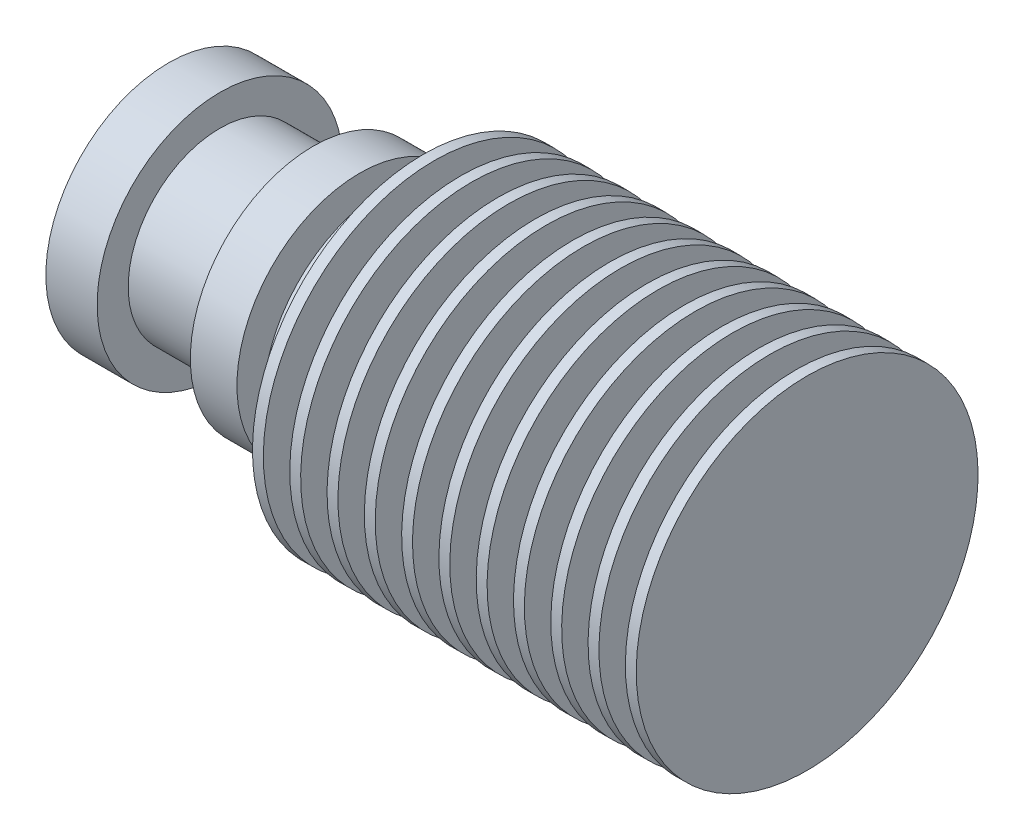
ISO-10303-21;
HEADER;
FILE_DESCRIPTION(('STEP AP214'),'2;1');
FILE_NAME('part.step','',(''),(''),'','','');
FILE_SCHEMA(('AUTOMOTIVE_DESIGN { 1 0 10303 214 1 1 1 1 }'));
ENDSEC;
DATA;
#1=APPLICATION_CONTEXT('core data for automotive mechanical design processes');
#2=APPLICATION_PROTOCOL_DEFINITION('international standard','automotive_design',2000,#1);
#3=PRODUCT_CONTEXT('',#1,'mechanical');
#4=PRODUCT('Part','Part','',(#3));
#5=PRODUCT_RELATED_PRODUCT_CATEGORY('part','',(#4));
#6=PRODUCT_DEFINITION_FORMATION('','',#4);
#7=PRODUCT_DEFINITION_CONTEXT('part definition',#1,'design');
#8=PRODUCT_DEFINITION('design','',#6,#7);
#9=PRODUCT_DEFINITION_SHAPE('','',#8);
#10=(LENGTH_UNIT() NAMED_UNIT(*) SI_UNIT(.MILLI.,.METRE.));
#11=(NAMED_UNIT(*) PLANE_ANGLE_UNIT() SI_UNIT($,.RADIAN.));
#12=(NAMED_UNIT(*) SI_UNIT($,.STERADIAN.) SOLID_ANGLE_UNIT());
#13=UNCERTAINTY_MEASURE_WITH_UNIT(LENGTH_MEASURE(1.E-05),#10,'distance_accuracy_value','');
#14=(GEOMETRIC_REPRESENTATION_CONTEXT(3) GLOBAL_UNCERTAINTY_ASSIGNED_CONTEXT((#13)) GLOBAL_UNIT_ASSIGNED_CONTEXT((#10,
#11,#12)) REPRESENTATION_CONTEXT('',''));
#15=CARTESIAN_POINT('',(0.,0.,0.));
#16=DIRECTION('',(0.,0.,1.));
#17=DIRECTION('',(1.,0.,0.));
#18=AXIS2_PLACEMENT_3D('',#15,#16,#17);
#19=CARTESIAN_POINT('',(-27.999975,5.,0.));
#20=DIRECTION('',(1.,0.,0.));
#21=DIRECTION('',(0.,1.,0.));
#22=AXIS2_PLACEMENT_3D('',#19,#20,#21);
#23=PLANE('',#22);
#24=CARTESIAN_POINT('',(-27.999975,5.,0.));
#25=DIRECTION('',(1.,0.,0.));
#26=DIRECTION('',(0.,1.,0.));
#27=AXIS2_PLACEMENT_3D('',#24,#25,#26);
#28=CIRCLE('',#27,11.);
#29=CARTESIAN_POINT('',(-27.999975,16.,0.));
#30=VERTEX_POINT('',#29);
#31=EDGE_CURVE('E10',#30,#30,#28,.T.);
#32=ORIENTED_EDGE('',*,*,#31,.T.);
#33=EDGE_LOOP('',(#32));
#34=FACE_BOUND('',#33,.T.);
#35=ADVANCED_FACE('F32',(#34),#23,.T.);
#36=CARTESIAN_POINT('',(-27.999975,5.,0.));
#37=DIRECTION('',(1.,0.,0.));
#38=DIRECTION('',(0.,1.,0.));
#39=AXIS2_PLACEMENT_3D('',#36,#37,#38);
#40=CYLINDRICAL_SURFACE('',#39,11.);
#41=CARTESIAN_POINT('',(-28.699975,5.,0.));
#42=DIRECTION('',(1.,0.,0.));
#43=DIRECTION('',(0.,1.,0.));
#44=AXIS2_PLACEMENT_3D('',#41,#42,#43);
#45=CIRCLE('',#44,11.);
#46=CARTESIAN_POINT('',(-28.699975,16.,0.));
#47=VERTEX_POINT('',#46);
#48=EDGE_CURVE('E38',#47,#47,#45,.T.);
#49=ORIENTED_EDGE('',*,*,#48,.T.);
#50=EDGE_LOOP('',(#49));
#51=FACE_BOUND('',#50,.T.);
#52=ORIENTED_EDGE('',*,*,#31,.F.);
#53=EDGE_LOOP('',(#52));
#54=FACE_BOUND('',#53,.T.);
#55=ADVANCED_FACE('F531',(#51,#54),#40,.T.);
#56=CARTESIAN_POINT('',(-28.699975,16.,0.));
#57=DIRECTION('',(-1.,0.,0.));
#58=DIRECTION('',(0.,-1.,0.));
#59=AXIS2_PLACEMENT_3D('',#56,#57,#58);
#60=PLANE('',#59);
#61=CARTESIAN_POINT('',(-28.699975,5.,0.));
#62=DIRECTION('',(1.,0.,0.));
#63=DIRECTION('',(0.,1.,0.));
#64=AXIS2_PLACEMENT_3D('',#61,#62,#63);
#65=CIRCLE('',#64,5.);
#66=CARTESIAN_POINT('',(-28.699975,10.,0.));
#67=VERTEX_POINT('',#66);
#68=EDGE_CURVE('E42',#67,#67,#65,.T.);
#69=ORIENTED_EDGE('',*,*,#68,.T.);
#70=EDGE_LOOP('',(#69));
#71=FACE_BOUND('',#70,.T.);
#72=ORIENTED_EDGE('',*,*,#48,.F.);
#73=EDGE_LOOP('',(#72));
#74=FACE_BOUND('',#73,.T.);
#75=ADVANCED_FACE('F525',(#71,#74),#60,.T.);
#76=CARTESIAN_POINT('',(-27.999975,5.,0.));
#77=DIRECTION('',(1.,0.,0.));
#78=DIRECTION('',(0.,1.,0.));
#79=AXIS2_PLACEMENT_3D('',#76,#77,#78);
#80=CYLINDRICAL_SURFACE('',#79,5.);
#81=CARTESIAN_POINT('',(-30.399975,5.,0.));
#82=DIRECTION('',(1.,0.,0.));
#83=DIRECTION('',(0.,1.,0.));
#84=AXIS2_PLACEMENT_3D('',#81,#82,#83);
#85=CIRCLE('',#84,5.);
#86=CARTESIAN_POINT('',(-30.399975,10.,0.));
#87=VERTEX_POINT('',#86);
#88=EDGE_CURVE('E46',#87,#87,#85,.T.);
#89=ORIENTED_EDGE('',*,*,#88,.T.);
#90=EDGE_LOOP('',(#89));
#91=FACE_BOUND('',#90,.T.);
#92=ORIENTED_EDGE('',*,*,#68,.F.);
#93=EDGE_LOOP('',(#92));
#94=FACE_BOUND('',#93,.T.);
#95=ADVANCED_FACE('F519',(#91,#94),#80,.T.);
#96=CARTESIAN_POINT('',(-30.399975,10.,0.));
#97=DIRECTION('',(1.,0.,0.));
#98=DIRECTION('',(0.,1.,0.));
#99=AXIS2_PLACEMENT_3D('',#96,#97,#98);
#100=PLANE('',#99);
#101=CARTESIAN_POINT('',(-30.399975,5.,0.));
#102=DIRECTION('',(1.,0.,0.));
#103=DIRECTION('',(0.,1.,0.));
#104=AXIS2_PLACEMENT_3D('',#101,#102,#103);
#105=CIRCLE('',#104,11.);
#106=CARTESIAN_POINT('',(-30.399975,16.,0.));
#107=VERTEX_POINT('',#106);
#108=EDGE_CURVE('E51',#107,#107,#105,.T.);
#109=ORIENTED_EDGE('',*,*,#108,.T.);
#110=EDGE_LOOP('',(#109));
#111=FACE_BOUND('',#110,.T.);
#112=ORIENTED_EDGE('',*,*,#88,.F.);
#113=EDGE_LOOP('',(#112));
#114=FACE_BOUND('',#113,.T.);
#115=ADVANCED_FACE('F513',(#111,#114),#100,.T.);
#116=CARTESIAN_POINT('',(-27.999975,5.,0.));
#117=DIRECTION('',(1.,0.,0.));
#118=DIRECTION('',(0.,1.,0.));
#119=AXIS2_PLACEMENT_3D('',#116,#117,#118);
#120=CYLINDRICAL_SURFACE('',#119,11.);
#121=CARTESIAN_POINT('',(-31.099975,5.,0.));
#122=DIRECTION('',(1.,0.,0.));
#123=DIRECTION('',(0.,1.,0.));
#124=AXIS2_PLACEMENT_3D('',#121,#122,#123);
#125=CIRCLE('',#124,11.);
#126=CARTESIAN_POINT('',(-31.099975,16.,0.));
#127=VERTEX_POINT('',#126);
#128=EDGE_CURVE('E54',#127,#127,#125,.T.);
#129=ORIENTED_EDGE('',*,*,#128,.T.);
#130=EDGE_LOOP('',(#129));
#131=FACE_BOUND('',#130,.T.);
#132=ORIENTED_EDGE('',*,*,#108,.F.);
#133=EDGE_LOOP('',(#132));
#134=FACE_BOUND('',#133,.T.);
#135=ADVANCED_FACE('F507',(#131,#134),#120,.T.);
#136=CARTESIAN_POINT('',(-31.099975,16.,0.));
#137=DIRECTION('',(-1.,0.,0.));
#138=DIRECTION('',(0.,-1.,0.));
#139=AXIS2_PLACEMENT_3D('',#136,#137,#138);
#140=PLANE('',#139);
#141=CARTESIAN_POINT('',(-31.099975,5.,0.));
#142=DIRECTION('',(1.,0.,0.));
#143=DIRECTION('',(0.,1.,0.));
#144=AXIS2_PLACEMENT_3D('',#141,#142,#143);
#145=CIRCLE('',#144,4.99999999999998);
#146=CARTESIAN_POINT('',(-31.099975,9.99999999999998,0.));
#147=VERTEX_POINT('',#146);
#148=EDGE_CURVE('E57',#147,#147,#145,.T.);
#149=ORIENTED_EDGE('',*,*,#148,.T.);
#150=EDGE_LOOP('',(#149));
#151=FACE_BOUND('',#150,.T.);
#152=ORIENTED_EDGE('',*,*,#128,.F.);
#153=EDGE_LOOP('',(#152));
#154=FACE_BOUND('',#153,.T.);
#155=ADVANCED_FACE('F501',(#151,#154),#140,.T.);
#156=CARTESIAN_POINT('',(-27.999975,5.,0.));
#157=DIRECTION('',(1.,0.,0.));
#158=DIRECTION('',(0.,1.,0.));
#159=AXIS2_PLACEMENT_3D('',#156,#157,#158);
#160=CYLINDRICAL_SURFACE('',#159,4.99999999999998);
#161=CARTESIAN_POINT('',(-32.799975,5.,0.));
#162=DIRECTION('',(1.,0.,0.));
#163=DIRECTION('',(0.,1.,0.));
#164=AXIS2_PLACEMENT_3D('',#161,#162,#163);
#165=CIRCLE('',#164,4.99999999999999);
#166=CARTESIAN_POINT('',(-32.799975,9.99999999999998,0.));
#167=VERTEX_POINT('',#166);
#168=EDGE_CURVE('E60',#167,#167,#165,.T.);
#169=ORIENTED_EDGE('',*,*,#168,.T.);
#170=EDGE_LOOP('',(#169));
#171=FACE_BOUND('',#170,.T.);
#172=ORIENTED_EDGE('',*,*,#148,.F.);
#173=EDGE_LOOP('',(#172));
#174=FACE_BOUND('',#173,.T.);
#175=ADVANCED_FACE('F495',(#171,#174),#160,.T.);
#176=CARTESIAN_POINT('',(-32.799975,9.99999999999998,0.));
#177=DIRECTION('',(1.,0.,0.));
#178=DIRECTION('',(0.,1.,0.));
#179=AXIS2_PLACEMENT_3D('',#176,#177,#178);
#180=PLANE('',#179);
#181=CARTESIAN_POINT('',(-32.799975,5.,0.));
#182=DIRECTION('',(1.,0.,0.));
#183=DIRECTION('',(0.,1.,0.));
#184=AXIS2_PLACEMENT_3D('',#181,#182,#183);
#185=CIRCLE('',#184,11.);
#186=CARTESIAN_POINT('',(-32.799975,16.,0.));
#187=VERTEX_POINT('',#186);
#188=EDGE_CURVE('E63',#187,#187,#185,.T.);
#189=ORIENTED_EDGE('',*,*,#188,.T.);
#190=EDGE_LOOP('',(#189));
#191=FACE_BOUND('',#190,.T.);
#192=ORIENTED_EDGE('',*,*,#168,.F.);
#193=EDGE_LOOP('',(#192));
#194=FACE_BOUND('',#193,.T.);
#195=ADVANCED_FACE('F489',(#191,#194),#180,.T.);
#196=CARTESIAN_POINT('',(-27.999975,5.,0.));
#197=DIRECTION('',(1.,0.,0.));
#198=DIRECTION('',(0.,1.,0.));
#199=AXIS2_PLACEMENT_3D('',#196,#197,#198);
#200=CYLINDRICAL_SURFACE('',#199,11.);
#201=CARTESIAN_POINT('',(-33.499975,5.,0.));
#202=DIRECTION('',(1.,0.,0.));
#203=DIRECTION('',(0.,1.,0.));
#204=AXIS2_PLACEMENT_3D('',#201,#202,#203);
#205=CIRCLE('',#204,11.);
#206=CARTESIAN_POINT('',(-33.499975,16.,0.));
#207=VERTEX_POINT('',#206);
#208=EDGE_CURVE('E66',#207,#207,#205,.T.);
#209=ORIENTED_EDGE('',*,*,#208,.T.);
#210=EDGE_LOOP('',(#209));
#211=FACE_BOUND('',#210,.T.);
#212=ORIENTED_EDGE('',*,*,#188,.F.);
#213=EDGE_LOOP('',(#212));
#214=FACE_BOUND('',#213,.T.);
#215=ADVANCED_FACE('F483',(#211,#214),#200,.T.);
#216=CARTESIAN_POINT('',(-33.499975,16.,0.));
#217=DIRECTION('',(-1.,0.,0.));
#218=DIRECTION('',(0.,-1.,0.));
#219=AXIS2_PLACEMENT_3D('',#216,#217,#218);
#220=PLANE('',#219);
#221=CARTESIAN_POINT('',(-33.499975,5.,0.));
#222=DIRECTION('',(1.,0.,0.));
#223=DIRECTION('',(0.,1.,0.));
#224=AXIS2_PLACEMENT_3D('',#221,#222,#223);
#225=CIRCLE('',#224,4.99999999999997);
#226=CARTESIAN_POINT('',(-33.499975,9.99999999999997,0.));
#227=VERTEX_POINT('',#226);
#228=EDGE_CURVE('E69',#227,#227,#225,.T.);
#229=ORIENTED_EDGE('',*,*,#228,.T.);
#230=EDGE_LOOP('',(#229));
#231=FACE_BOUND('',#230,.T.);
#232=ORIENTED_EDGE('',*,*,#208,.F.);
#233=EDGE_LOOP('',(#232));
#234=FACE_BOUND('',#233,.T.);
#235=ADVANCED_FACE('F477',(#231,#234),#220,.T.);
#236=CARTESIAN_POINT('',(-27.999975,5.,0.));
#237=DIRECTION('',(1.,0.,0.));
#238=DIRECTION('',(0.,1.,0.));
#239=AXIS2_PLACEMENT_3D('',#236,#237,#238);
#240=CYLINDRICAL_SURFACE('',#239,4.99999999999997);
#241=CARTESIAN_POINT('',(-35.199975,5.,0.));
#242=DIRECTION('',(1.,0.,0.));
#243=DIRECTION('',(0.,1.,0.));
#244=AXIS2_PLACEMENT_3D('',#241,#242,#243);
#245=CIRCLE('',#244,4.99999999999997);
#246=CARTESIAN_POINT('',(-35.199975,9.99999999999997,0.));
#247=VERTEX_POINT('',#246);
#248=EDGE_CURVE('E72',#247,#247,#245,.T.);
#249=ORIENTED_EDGE('',*,*,#248,.T.);
#250=EDGE_LOOP('',(#249));
#251=FACE_BOUND('',#250,.T.);
#252=ORIENTED_EDGE('',*,*,#228,.F.);
#253=EDGE_LOOP('',(#252));
#254=FACE_BOUND('',#253,.T.);
#255=ADVANCED_FACE('F471',(#251,#254),#240,.T.);
#256=CARTESIAN_POINT('',(-35.199975,9.99999999999997,0.));
#257=DIRECTION('',(1.,0.,0.));
#258=DIRECTION('',(0.,1.,0.));
#259=AXIS2_PLACEMENT_3D('',#256,#257,#258);
#260=PLANE('',#259);
#261=CARTESIAN_POINT('',(-35.199975,5.,0.));
#262=DIRECTION('',(1.,0.,0.));
#263=DIRECTION('',(0.,1.,0.));
#264=AXIS2_PLACEMENT_3D('',#261,#262,#263);
#265=CIRCLE('',#264,11.);
#266=CARTESIAN_POINT('',(-35.199975,16.,0.));
#267=VERTEX_POINT('',#266);
#268=EDGE_CURVE('E75',#267,#267,#265,.T.);
#269=ORIENTED_EDGE('',*,*,#268,.T.);
#270=EDGE_LOOP('',(#269));
#271=FACE_BOUND('',#270,.T.);
#272=ORIENTED_EDGE('',*,*,#248,.F.);
#273=EDGE_LOOP('',(#272));
#274=FACE_BOUND('',#273,.T.);
#275=ADVANCED_FACE('F465',(#271,#274),#260,.T.);
#276=CARTESIAN_POINT('',(-27.999975,5.,0.));
#277=DIRECTION('',(1.,0.,0.));
#278=DIRECTION('',(0.,1.,0.));
#279=AXIS2_PLACEMENT_3D('',#276,#277,#278);
#280=CYLINDRICAL_SURFACE('',#279,11.);
#281=CARTESIAN_POINT('',(-35.899975,5.,0.));
#282=DIRECTION('',(1.,0.,0.));
#283=DIRECTION('',(0.,1.,0.));
#284=AXIS2_PLACEMENT_3D('',#281,#282,#283);
#285=CIRCLE('',#284,11.);
#286=CARTESIAN_POINT('',(-35.899975,16.,0.));
#287=VERTEX_POINT('',#286);
#288=EDGE_CURVE('E78',#287,#287,#285,.T.);
#289=ORIENTED_EDGE('',*,*,#288,.T.);
#290=EDGE_LOOP('',(#289));
#291=FACE_BOUND('',#290,.T.);
#292=ORIENTED_EDGE('',*,*,#268,.F.);
#293=EDGE_LOOP('',(#292));
#294=FACE_BOUND('',#293,.T.);
#295=ADVANCED_FACE('F459',(#291,#294),#280,.T.);
#296=CARTESIAN_POINT('',(-35.899975,16.,0.));
#297=DIRECTION('',(-1.,0.,0.));
#298=DIRECTION('',(0.,-1.,0.));
#299=AXIS2_PLACEMENT_3D('',#296,#297,#298);
#300=PLANE('',#299);
#301=CARTESIAN_POINT('',(-35.899975,5.,0.));
#302=DIRECTION('',(1.,0.,0.));
#303=DIRECTION('',(0.,1.,0.));
#304=AXIS2_PLACEMENT_3D('',#301,#302,#303);
#305=CIRCLE('',#304,4.99999999999995);
#306=CARTESIAN_POINT('',(-35.899975,9.99999999999995,0.));
#307=VERTEX_POINT('',#306);
#308=EDGE_CURVE('E81',#307,#307,#305,.T.);
#309=ORIENTED_EDGE('',*,*,#308,.T.);
#310=EDGE_LOOP('',(#309));
#311=FACE_BOUND('',#310,.T.);
#312=ORIENTED_EDGE('',*,*,#288,.F.);
#313=EDGE_LOOP('',(#312));
#314=FACE_BOUND('',#313,.T.);
#315=ADVANCED_FACE('F453',(#311,#314),#300,.T.);
#316=CARTESIAN_POINT('',(-27.999975,5.,0.));
#317=DIRECTION('',(1.,0.,0.));
#318=DIRECTION('',(0.,1.,0.));
#319=AXIS2_PLACEMENT_3D('',#316,#317,#318);
#320=CYLINDRICAL_SURFACE('',#319,4.99999999999995);
#321=CARTESIAN_POINT('',(-37.599975,5.,0.));
#322=DIRECTION('',(1.,0.,0.));
#323=DIRECTION('',(0.,1.,0.));
#324=AXIS2_PLACEMENT_3D('',#321,#322,#323);
#325=CIRCLE('',#324,4.99999999999995);
#326=CARTESIAN_POINT('',(-37.599975,9.99999999999995,0.));
#327=VERTEX_POINT('',#326);
#328=EDGE_CURVE('E84',#327,#327,#325,.T.);
#329=ORIENTED_EDGE('',*,*,#328,.T.);
#330=EDGE_LOOP('',(#329));
#331=FACE_BOUND('',#330,.T.);
#332=ORIENTED_EDGE('',*,*,#308,.F.);
#333=EDGE_LOOP('',(#332));
#334=FACE_BOUND('',#333,.T.);
#335=ADVANCED_FACE('F447',(#331,#334),#320,.T.);
#336=CARTESIAN_POINT('',(-37.599975,9.99999999999995,0.));
#337=DIRECTION('',(1.,0.,0.));
#338=DIRECTION('',(0.,1.,0.));
#339=AXIS2_PLACEMENT_3D('',#336,#337,#338);
#340=PLANE('',#339);
#341=CARTESIAN_POINT('',(-37.599975,5.,0.));
#342=DIRECTION('',(1.,0.,0.));
#343=DIRECTION('',(0.,1.,0.));
#344=AXIS2_PLACEMENT_3D('',#341,#342,#343);
#345=CIRCLE('',#344,10.9999999999999);
#346=CARTESIAN_POINT('',(-37.599975,15.9999999999999,0.));
#347=VERTEX_POINT('',#346);
#348=EDGE_CURVE('E87',#347,#347,#345,.T.);
#349=ORIENTED_EDGE('',*,*,#348,.T.);
#350=EDGE_LOOP('',(#349));
#351=FACE_BOUND('',#350,.T.);
#352=ORIENTED_EDGE('',*,*,#328,.F.);
#353=EDGE_LOOP('',(#352));
#354=FACE_BOUND('',#353,.T.);
#355=ADVANCED_FACE('F441',(#351,#354),#340,.T.);
#356=CARTESIAN_POINT('',(-27.999975,5.,0.));
#357=DIRECTION('',(1.,0.,0.));
#358=DIRECTION('',(0.,1.,0.));
#359=AXIS2_PLACEMENT_3D('',#356,#357,#358);
#360=CYLINDRICAL_SURFACE('',#359,10.9999999999999);
#361=CARTESIAN_POINT('',(-38.299975,5.,0.));
#362=DIRECTION('',(1.,0.,0.));
#363=DIRECTION('',(0.,1.,0.));
#364=AXIS2_PLACEMENT_3D('',#361,#362,#363);
#365=CIRCLE('',#364,10.9999999999999);
#366=CARTESIAN_POINT('',(-38.299975,15.9999999999999,0.));
#367=VERTEX_POINT('',#366);
#368=EDGE_CURVE('E90',#367,#367,#365,.T.);
#369=ORIENTED_EDGE('',*,*,#368,.T.);
#370=EDGE_LOOP('',(#369));
#371=FACE_BOUND('',#370,.T.);
#372=ORIENTED_EDGE('',*,*,#348,.F.);
#373=EDGE_LOOP('',(#372));
#374=FACE_BOUND('',#373,.T.);
#375=ADVANCED_FACE('F435',(#371,#374),#360,.T.);
#376=CARTESIAN_POINT('',(-38.299975,15.9999999999999,0.));
#377=DIRECTION('',(-1.,0.,0.));
#378=DIRECTION('',(0.,-1.,0.));
#379=AXIS2_PLACEMENT_3D('',#376,#377,#378);
#380=PLANE('',#379);
#381=CARTESIAN_POINT('',(-38.299975,5.,0.));
#382=DIRECTION('',(1.,0.,0.));
#383=DIRECTION('',(0.,1.,0.));
#384=AXIS2_PLACEMENT_3D('',#381,#382,#383);
#385=CIRCLE('',#384,4.99999999999993);
#386=CARTESIAN_POINT('',(-38.299975,9.99999999999993,0.));
#387=VERTEX_POINT('',#386);
#388=EDGE_CURVE('E93',#387,#387,#385,.T.);
#389=ORIENTED_EDGE('',*,*,#388,.T.);
#390=EDGE_LOOP('',(#389));
#391=FACE_BOUND('',#390,.T.);
#392=ORIENTED_EDGE('',*,*,#368,.F.);
#393=EDGE_LOOP('',(#392));
#394=FACE_BOUND('',#393,.T.);
#395=ADVANCED_FACE('F429',(#391,#394),#380,.T.);
#396=CARTESIAN_POINT('',(-27.999975,5.,0.));
#397=DIRECTION('',(1.,0.,0.));
#398=DIRECTION('',(0.,1.,0.));
#399=AXIS2_PLACEMENT_3D('',#396,#397,#398);
#400=CYLINDRICAL_SURFACE('',#399,4.99999999999994);
#401=CARTESIAN_POINT('',(-39.999975,5.,0.));
#402=DIRECTION('',(1.,0.,0.));
#403=DIRECTION('',(0.,1.,0.));
#404=AXIS2_PLACEMENT_3D('',#401,#402,#403);
#405=CIRCLE('',#404,4.99999999999994);
#406=CARTESIAN_POINT('',(-39.999975,9.99999999999993,0.));
#407=VERTEX_POINT('',#406);
#408=EDGE_CURVE('E96',#407,#407,#405,.T.);
#409=ORIENTED_EDGE('',*,*,#408,.T.);
#410=EDGE_LOOP('',(#409));
#411=FACE_BOUND('',#410,.T.);
#412=ORIENTED_EDGE('',*,*,#388,.F.);
#413=EDGE_LOOP('',(#412));
#414=FACE_BOUND('',#413,.T.);
#415=ADVANCED_FACE('F423',(#411,#414),#400,.T.);
#416=CARTESIAN_POINT('',(-39.999975,9.99999999999993,0.));
#417=DIRECTION('',(1.,0.,0.));
#418=DIRECTION('',(0.,1.,0.));
#419=AXIS2_PLACEMENT_3D('',#416,#417,#418);
#420=PLANE('',#419);
#421=CARTESIAN_POINT('',(-39.999975,5.,0.));
#422=DIRECTION('',(1.,0.,0.));
#423=DIRECTION('',(0.,1.,0.));
#424=AXIS2_PLACEMENT_3D('',#421,#422,#423);
#425=CIRCLE('',#424,10.9999999999999);
#426=CARTESIAN_POINT('',(-39.999975,15.9999999999999,0.));
#427=VERTEX_POINT('',#426);
#428=EDGE_CURVE('E99',#427,#427,#425,.T.);
#429=ORIENTED_EDGE('',*,*,#428,.T.);
#430=EDGE_LOOP('',(#429));
#431=FACE_BOUND('',#430,.T.);
#432=ORIENTED_EDGE('',*,*,#408,.F.);
#433=EDGE_LOOP('',(#432));
#434=FACE_BOUND('',#433,.T.);
#435=ADVANCED_FACE('F417',(#431,#434),#420,.T.);
#436=CARTESIAN_POINT('',(-27.999975,5.,0.));
#437=DIRECTION('',(1.,0.,0.));
#438=DIRECTION('',(0.,1.,0.));
#439=AXIS2_PLACEMENT_3D('',#436,#437,#438);
#440=CYLINDRICAL_SURFACE('',#439,10.9999999999999);
#441=CARTESIAN_POINT('',(-40.699975,5.,0.));
#442=DIRECTION('',(1.,0.,0.));
#443=DIRECTION('',(0.,1.,0.));
#444=AXIS2_PLACEMENT_3D('',#441,#442,#443);
#445=CIRCLE('',#444,10.9999999999999);
#446=CARTESIAN_POINT('',(-40.699975,15.9999999999999,0.));
#447=VERTEX_POINT('',#446);
#448=EDGE_CURVE('E102',#447,#447,#445,.T.);
#449=ORIENTED_EDGE('',*,*,#448,.T.);
#450=EDGE_LOOP('',(#449));
#451=FACE_BOUND('',#450,.T.);
#452=ORIENTED_EDGE('',*,*,#428,.F.);
#453=EDGE_LOOP('',(#452));
#454=FACE_BOUND('',#453,.T.);
#455=ADVANCED_FACE('F411',(#451,#454),#440,.T.);
#456=CARTESIAN_POINT('',(-40.699975,15.9999999999999,0.));
#457=DIRECTION('',(-1.,0.,0.));
#458=DIRECTION('',(0.,-1.,0.));
#459=AXIS2_PLACEMENT_3D('',#456,#457,#458);
#460=PLANE('',#459);
#461=CARTESIAN_POINT('',(-40.699975,5.,0.));
#462=DIRECTION('',(1.,0.,0.));
#463=DIRECTION('',(0.,1.,0.));
#464=AXIS2_PLACEMENT_3D('',#461,#462,#463);
#465=CIRCLE('',#464,4.99999999999992);
#466=CARTESIAN_POINT('',(-40.699975,9.99999999999992,0.));
#467=VERTEX_POINT('',#466);
#468=EDGE_CURVE('E105',#467,#467,#465,.T.);
#469=ORIENTED_EDGE('',*,*,#468,.T.);
#470=EDGE_LOOP('',(#469));
#471=FACE_BOUND('',#470,.T.);
#472=ORIENTED_EDGE('',*,*,#448,.F.);
#473=EDGE_LOOP('',(#472));
#474=FACE_BOUND('',#473,.T.);
#475=ADVANCED_FACE('F405',(#471,#474),#460,.T.);
#476=CARTESIAN_POINT('',(-27.999975,5.,0.));
#477=DIRECTION('',(1.,0.,0.));
#478=DIRECTION('',(0.,1.,0.));
#479=AXIS2_PLACEMENT_3D('',#476,#477,#478);
#480=CYLINDRICAL_SURFACE('',#479,4.99999999999992);
#481=CARTESIAN_POINT('',(-42.399975,5.,0.));
#482=DIRECTION('',(1.,0.,0.));
#483=DIRECTION('',(0.,1.,0.));
#484=AXIS2_PLACEMENT_3D('',#481,#482,#483);
#485=CIRCLE('',#484,4.99999999999992);
#486=CARTESIAN_POINT('',(-42.399975,9.99999999999992,0.));
#487=VERTEX_POINT('',#486);
#488=EDGE_CURVE('E108',#487,#487,#485,.T.);
#489=ORIENTED_EDGE('',*,*,#488,.T.);
#490=EDGE_LOOP('',(#489));
#491=FACE_BOUND('',#490,.T.);
#492=ORIENTED_EDGE('',*,*,#468,.F.);
#493=EDGE_LOOP('',(#492));
#494=FACE_BOUND('',#493,.T.);
#495=ADVANCED_FACE('F399',(#491,#494),#480,.T.);
#496=CARTESIAN_POINT('',(-42.399975,9.99999999999992,0.));
#497=DIRECTION('',(1.,0.,0.));
#498=DIRECTION('',(0.,1.,0.));
#499=AXIS2_PLACEMENT_3D('',#496,#497,#498);
#500=PLANE('',#499);
#501=CARTESIAN_POINT('',(-42.399975,5.,0.));
#502=DIRECTION('',(1.,0.,0.));
#503=DIRECTION('',(0.,1.,0.));
#504=AXIS2_PLACEMENT_3D('',#501,#502,#503);
#505=CIRCLE('',#504,10.9999999999999);
#506=CARTESIAN_POINT('',(-42.399975,15.9999999999999,0.));
#507=VERTEX_POINT('',#506);
#508=EDGE_CURVE('E111',#507,#507,#505,.T.);
#509=ORIENTED_EDGE('',*,*,#508,.T.);
#510=EDGE_LOOP('',(#509));
#511=FACE_BOUND('',#510,.T.);
#512=ORIENTED_EDGE('',*,*,#488,.F.);
#513=EDGE_LOOP('',(#512));
#514=FACE_BOUND('',#513,.T.);
#515=ADVANCED_FACE('F393',(#511,#514),#500,.T.);
#516=CARTESIAN_POINT('',(-27.999975,5.,0.));
#517=DIRECTION('',(1.,0.,0.));
#518=DIRECTION('',(0.,1.,0.));
#519=AXIS2_PLACEMENT_3D('',#516,#517,#518);
#520=CYLINDRICAL_SURFACE('',#519,10.9999999999999);
#521=CARTESIAN_POINT('',(-43.099975,5.,0.));
#522=DIRECTION('',(1.,0.,0.));
#523=DIRECTION('',(0.,1.,0.));
#524=AXIS2_PLACEMENT_3D('',#521,#522,#523);
#525=CIRCLE('',#524,10.9999999999999);
#526=CARTESIAN_POINT('',(-43.099975,15.9999999999999,0.));
#527=VERTEX_POINT('',#526);
#528=EDGE_CURVE('E114',#527,#527,#525,.T.);
#529=ORIENTED_EDGE('',*,*,#528,.T.);
#530=EDGE_LOOP('',(#529));
#531=FACE_BOUND('',#530,.T.);
#532=ORIENTED_EDGE('',*,*,#508,.F.);
#533=EDGE_LOOP('',(#532));
#534=FACE_BOUND('',#533,.T.);
#535=ADVANCED_FACE('F387',(#531,#534),#520,.T.);
#536=CARTESIAN_POINT('',(-43.099975,15.9999999999999,0.));
#537=DIRECTION('',(-1.,0.,0.));
#538=DIRECTION('',(0.,-1.,0.));
#539=AXIS2_PLACEMENT_3D('',#536,#537,#538);
#540=PLANE('',#539);
#541=CARTESIAN_POINT('',(-43.099975,5.,0.));
#542=DIRECTION('',(1.,0.,0.));
#543=DIRECTION('',(0.,1.,0.));
#544=AXIS2_PLACEMENT_3D('',#541,#542,#543);
#545=CIRCLE('',#544,4.9999999999999);
#546=CARTESIAN_POINT('',(-43.099975,9.9999999999999,0.));
#547=VERTEX_POINT('',#546);
#548=EDGE_CURVE('E117',#547,#547,#545,.T.);
#549=ORIENTED_EDGE('',*,*,#548,.T.);
#550=EDGE_LOOP('',(#549));
#551=FACE_BOUND('',#550,.T.);
#552=ORIENTED_EDGE('',*,*,#528,.F.);
#553=EDGE_LOOP('',(#552));
#554=FACE_BOUND('',#553,.T.);
#555=ADVANCED_FACE('F381',(#551,#554),#540,.T.);
#556=CARTESIAN_POINT('',(-27.999975,5.,0.));
#557=DIRECTION('',(1.,0.,0.));
#558=DIRECTION('',(0.,1.,0.));
#559=AXIS2_PLACEMENT_3D('',#556,#557,#558);
#560=CYLINDRICAL_SURFACE('',#559,4.9999999999999);
#561=CARTESIAN_POINT('',(-44.799975,5.,0.));
#562=DIRECTION('',(1.,0.,0.));
#563=DIRECTION('',(0.,1.,0.));
#564=AXIS2_PLACEMENT_3D('',#561,#562,#563);
#565=CIRCLE('',#564,4.9999999999999);
#566=CARTESIAN_POINT('',(-44.799975,9.9999999999999,0.));
#567=VERTEX_POINT('',#566);
#568=EDGE_CURVE('E120',#567,#567,#565,.T.);
#569=ORIENTED_EDGE('',*,*,#568,.T.);
#570=EDGE_LOOP('',(#569));
#571=FACE_BOUND('',#570,.T.);
#572=ORIENTED_EDGE('',*,*,#548,.F.);
#573=EDGE_LOOP('',(#572));
#574=FACE_BOUND('',#573,.T.);
#575=ADVANCED_FACE('F375',(#571,#574),#560,.T.);
#576=CARTESIAN_POINT('',(-44.799975,9.9999999999999,0.));
#577=DIRECTION('',(1.,0.,0.));
#578=DIRECTION('',(0.,1.,0.));
#579=AXIS2_PLACEMENT_3D('',#576,#577,#578);
#580=PLANE('',#579);
#581=CARTESIAN_POINT('',(-44.799975,5.,0.));
#582=DIRECTION('',(1.,0.,0.));
#583=DIRECTION('',(0.,1.,0.));
#584=AXIS2_PLACEMENT_3D('',#581,#582,#583);
#585=CIRCLE('',#584,10.9999999999999);
#586=CARTESIAN_POINT('',(-44.799975,15.9999999999999,0.));
#587=VERTEX_POINT('',#586);
#588=EDGE_CURVE('E123',#587,#587,#585,.T.);
#589=ORIENTED_EDGE('',*,*,#588,.T.);
#590=EDGE_LOOP('',(#589));
#591=FACE_BOUND('',#590,.T.);
#592=ORIENTED_EDGE('',*,*,#568,.F.);
#593=EDGE_LOOP('',(#592));
#594=FACE_BOUND('',#593,.T.);
#595=ADVANCED_FACE('F369',(#591,#594),#580,.T.);
#596=CARTESIAN_POINT('',(-27.999975,5.,0.));
#597=DIRECTION('',(1.,0.,0.));
#598=DIRECTION('',(0.,1.,0.));
#599=AXIS2_PLACEMENT_3D('',#596,#597,#598);
#600=CYLINDRICAL_SURFACE('',#599,10.9999999999999);
#601=CARTESIAN_POINT('',(-45.499975,5.,0.));
#602=DIRECTION('',(1.,0.,0.));
#603=DIRECTION('',(0.,1.,0.));
#604=AXIS2_PLACEMENT_3D('',#601,#602,#603);
#605=CIRCLE('',#604,10.9999999999999);
#606=CARTESIAN_POINT('',(-45.499975,15.9999999999999,0.));
#607=VERTEX_POINT('',#606);
#608=EDGE_CURVE('E126',#607,#607,#605,.T.);
#609=ORIENTED_EDGE('',*,*,#608,.T.);
#610=EDGE_LOOP('',(#609));
#611=FACE_BOUND('',#610,.T.);
#612=ORIENTED_EDGE('',*,*,#588,.F.);
#613=EDGE_LOOP('',(#612));
#614=FACE_BOUND('',#613,.T.);
#615=ADVANCED_FACE('F363',(#611,#614),#600,.T.);
#616=CARTESIAN_POINT('',(-45.499975,15.9999999999999,0.));
#617=DIRECTION('',(-1.,0.,0.));
#618=DIRECTION('',(0.,-1.,0.));
#619=AXIS2_PLACEMENT_3D('',#616,#617,#618);
#620=PLANE('',#619);
#621=CARTESIAN_POINT('',(-45.499975,5.,0.));
#622=DIRECTION('',(1.,0.,0.));
#623=DIRECTION('',(0.,1.,0.));
#624=AXIS2_PLACEMENT_3D('',#621,#622,#623);
#625=CIRCLE('',#624,4.99999999999988);
#626=CARTESIAN_POINT('',(-45.499975,9.99999999999988,0.));
#627=VERTEX_POINT('',#626);
#628=EDGE_CURVE('E129',#627,#627,#625,.T.);
#629=ORIENTED_EDGE('',*,*,#628,.T.);
#630=EDGE_LOOP('',(#629));
#631=FACE_BOUND('',#630,.T.);
#632=ORIENTED_EDGE('',*,*,#608,.F.);
#633=EDGE_LOOP('',(#632));
#634=FACE_BOUND('',#633,.T.);
#635=ADVANCED_FACE('F357',(#631,#634),#620,.T.);
#636=CARTESIAN_POINT('',(-27.999975,5.,0.));
#637=DIRECTION('',(1.,0.,0.));
#638=DIRECTION('',(0.,1.,0.));
#639=AXIS2_PLACEMENT_3D('',#636,#637,#638);
#640=CYLINDRICAL_SURFACE('',#639,4.99999999999989);
#641=CARTESIAN_POINT('',(-47.199975,5.,0.));
#642=DIRECTION('',(1.,0.,0.));
#643=DIRECTION('',(0.,1.,0.));
#644=AXIS2_PLACEMENT_3D('',#641,#642,#643);
#645=CIRCLE('',#644,4.99999999999989);
#646=CARTESIAN_POINT('',(-47.199975,9.99999999999988,0.));
#647=VERTEX_POINT('',#646);
#648=EDGE_CURVE('E132',#647,#647,#645,.T.);
#649=ORIENTED_EDGE('',*,*,#648,.T.);
#650=EDGE_LOOP('',(#649));
#651=FACE_BOUND('',#650,.T.);
#652=ORIENTED_EDGE('',*,*,#628,.F.);
#653=EDGE_LOOP('',(#652));
#654=FACE_BOUND('',#653,.T.);
#655=ADVANCED_FACE('F351',(#651,#654),#640,.T.);
#656=CARTESIAN_POINT('',(-47.199975,9.99999999999988,0.));
#657=DIRECTION('',(1.,0.,0.));
#658=DIRECTION('',(0.,1.,0.));
#659=AXIS2_PLACEMENT_3D('',#656,#657,#658);
#660=PLANE('',#659);
#661=CARTESIAN_POINT('',(-47.199975,5.,0.));
#662=DIRECTION('',(1.,0.,0.));
#663=DIRECTION('',(0.,1.,0.));
#664=AXIS2_PLACEMENT_3D('',#661,#662,#663);
#665=CIRCLE('',#664,10.9999999999999);
#666=CARTESIAN_POINT('',(-47.199975,15.9999999999999,0.));
#667=VERTEX_POINT('',#666);
#668=EDGE_CURVE('E135',#667,#667,#665,.T.);
#669=ORIENTED_EDGE('',*,*,#668,.T.);
#670=EDGE_LOOP('',(#669));
#671=FACE_BOUND('',#670,.T.);
#672=ORIENTED_EDGE('',*,*,#648,.F.);
#673=EDGE_LOOP('',(#672));
#674=FACE_BOUND('',#673,.T.);
#675=ADVANCED_FACE('F345',(#671,#674),#660,.T.);
#676=CARTESIAN_POINT('',(-27.999975,5.,0.));
#677=DIRECTION('',(1.,0.,0.));
#678=DIRECTION('',(0.,1.,0.));
#679=AXIS2_PLACEMENT_3D('',#676,#677,#678);
#680=CYLINDRICAL_SURFACE('',#679,10.9999999999999);
#681=CARTESIAN_POINT('',(-47.899975,5.,0.));
#682=DIRECTION('',(1.,0.,0.));
#683=DIRECTION('',(0.,1.,0.));
#684=AXIS2_PLACEMENT_3D('',#681,#682,#683);
#685=CIRCLE('',#684,10.9999999999999);
#686=CARTESIAN_POINT('',(-47.899975,15.9999999999999,0.));
#687=VERTEX_POINT('',#686);
#688=EDGE_CURVE('E138',#687,#687,#685,.T.);
#689=ORIENTED_EDGE('',*,*,#688,.T.);
#690=EDGE_LOOP('',(#689));
#691=FACE_BOUND('',#690,.T.);
#692=ORIENTED_EDGE('',*,*,#668,.F.);
#693=EDGE_LOOP('',(#692));
#694=FACE_BOUND('',#693,.T.);
#695=ADVANCED_FACE('F339',(#691,#694),#680,.T.);
#696=CARTESIAN_POINT('',(-47.899975,15.9999999999999,0.));
#697=DIRECTION('',(-1.,0.,0.));
#698=DIRECTION('',(0.,-1.,0.));
#699=AXIS2_PLACEMENT_3D('',#696,#697,#698);
#700=PLANE('',#699);
#701=CARTESIAN_POINT('',(-47.899975,5.,0.));
#702=DIRECTION('',(1.,0.,0.));
#703=DIRECTION('',(0.,1.,0.));
#704=AXIS2_PLACEMENT_3D('',#701,#702,#703);
#705=CIRCLE('',#704,4.99999999999987);
#706=CARTESIAN_POINT('',(-47.899975,9.99999999999987,0.));
#707=VERTEX_POINT('',#706);
#708=EDGE_CURVE('E141',#707,#707,#705,.T.);
#709=ORIENTED_EDGE('',*,*,#708,.T.);
#710=EDGE_LOOP('',(#709));
#711=FACE_BOUND('',#710,.T.);
#712=ORIENTED_EDGE('',*,*,#688,.F.);
#713=EDGE_LOOP('',(#712));
#714=FACE_BOUND('',#713,.T.);
#715=ADVANCED_FACE('F333',(#711,#714),#700,.T.);
#716=CARTESIAN_POINT('',(-27.999975,5.,0.));
#717=DIRECTION('',(1.,0.,0.));
#718=DIRECTION('',(0.,1.,0.));
#719=AXIS2_PLACEMENT_3D('',#716,#717,#718);
#720=CYLINDRICAL_SURFACE('',#719,4.99999999999987);
#721=CARTESIAN_POINT('',(-49.599975,5.,0.));
#722=DIRECTION('',(1.,0.,0.));
#723=DIRECTION('',(0.,1.,0.));
#724=AXIS2_PLACEMENT_3D('',#721,#722,#723);
#725=CIRCLE('',#724,4.99999999999987);
#726=CARTESIAN_POINT('',(-49.599975,9.99999999999987,0.));
#727=VERTEX_POINT('',#726);
#728=EDGE_CURVE('E144',#727,#727,#725,.T.);
#729=ORIENTED_EDGE('',*,*,#728,.T.);
#730=EDGE_LOOP('',(#729));
#731=FACE_BOUND('',#730,.T.);
#732=ORIENTED_EDGE('',*,*,#708,.F.);
#733=EDGE_LOOP('',(#732));
#734=FACE_BOUND('',#733,.T.);
#735=ADVANCED_FACE('F327',(#731,#734),#720,.T.);
#736=CARTESIAN_POINT('',(-49.599975,9.99999999999987,0.));
#737=DIRECTION('',(1.,0.,0.));
#738=DIRECTION('',(0.,1.,0.));
#739=AXIS2_PLACEMENT_3D('',#736,#737,#738);
#740=PLANE('',#739);
#741=CARTESIAN_POINT('',(-49.599975,5.,0.));
#742=DIRECTION('',(1.,0.,0.));
#743=DIRECTION('',(0.,1.,0.));
#744=AXIS2_PLACEMENT_3D('',#741,#742,#743);
#745=CIRCLE('',#744,10.9999999999999);
#746=CARTESIAN_POINT('',(-49.599975,15.9999999999999,0.));
#747=VERTEX_POINT('',#746);
#748=EDGE_CURVE('E147',#747,#747,#745,.T.);
#749=ORIENTED_EDGE('',*,*,#748,.T.);
#750=EDGE_LOOP('',(#749));
#751=FACE_BOUND('',#750,.T.);
#752=ORIENTED_EDGE('',*,*,#728,.F.);
#753=EDGE_LOOP('',(#752));
#754=FACE_BOUND('',#753,.T.);
#755=ADVANCED_FACE('F321',(#751,#754),#740,.T.);
#756=CARTESIAN_POINT('',(-27.999975,5.,0.));
#757=DIRECTION('',(1.,0.,0.));
#758=DIRECTION('',(0.,1.,0.));
#759=AXIS2_PLACEMENT_3D('',#756,#757,#758);
#760=CYLINDRICAL_SURFACE('',#759,10.9999999999999);
#761=CARTESIAN_POINT('',(-50.299975,5.,0.));
#762=DIRECTION('',(1.,0.,0.));
#763=DIRECTION('',(0.,1.,0.));
#764=AXIS2_PLACEMENT_3D('',#761,#762,#763);
#765=CIRCLE('',#764,10.9999999999999);
#766=CARTESIAN_POINT('',(-50.299975,15.9999999999999,0.));
#767=VERTEX_POINT('',#766);
#768=EDGE_CURVE('E150',#767,#767,#765,.T.);
#769=ORIENTED_EDGE('',*,*,#768,.T.);
#770=EDGE_LOOP('',(#769));
#771=FACE_BOUND('',#770,.T.);
#772=ORIENTED_EDGE('',*,*,#748,.F.);
#773=EDGE_LOOP('',(#772));
#774=FACE_BOUND('',#773,.T.);
#775=ADVANCED_FACE('F315',(#771,#774),#760,.T.);
#776=CARTESIAN_POINT('',(-50.299975,15.9999999999999,0.));
#777=DIRECTION('',(-1.,0.,0.));
#778=DIRECTION('',(0.,-1.,0.));
#779=AXIS2_PLACEMENT_3D('',#776,#777,#778);
#780=PLANE('',#779);
#781=CARTESIAN_POINT('',(-50.299975,5.,0.));
#782=DIRECTION('',(1.,0.,0.));
#783=DIRECTION('',(0.,1.,0.));
#784=AXIS2_PLACEMENT_3D('',#781,#782,#783);
#785=CIRCLE('',#784,4.99999999999985);
#786=CARTESIAN_POINT('',(-50.299975,9.99999999999985,0.));
#787=VERTEX_POINT('',#786);
#788=EDGE_CURVE('E153',#787,#787,#785,.T.);
#789=ORIENTED_EDGE('',*,*,#788,.T.);
#790=EDGE_LOOP('',(#789));
#791=FACE_BOUND('',#790,.T.);
#792=ORIENTED_EDGE('',*,*,#768,.F.);
#793=EDGE_LOOP('',(#792));
#794=FACE_BOUND('',#793,.T.);
#795=ADVANCED_FACE('F309',(#791,#794),#780,.T.);
#796=CARTESIAN_POINT('',(-27.999975,5.,0.));
#797=DIRECTION('',(1.,0.,0.));
#798=DIRECTION('',(0.,1.,0.));
#799=AXIS2_PLACEMENT_3D('',#796,#797,#798);
#800=CYLINDRICAL_SURFACE('',#799,4.99999999999985);
#801=CARTESIAN_POINT('',(-51.999975,5.,0.));
#802=DIRECTION('',(1.,0.,0.));
#803=DIRECTION('',(0.,1.,0.));
#804=AXIS2_PLACEMENT_3D('',#801,#802,#803);
#805=CIRCLE('',#804,4.99999999999985);
#806=CARTESIAN_POINT('',(-51.999975,9.99999999999985,0.));
#807=VERTEX_POINT('',#806);
#808=EDGE_CURVE('E156',#807,#807,#805,.T.);
#809=ORIENTED_EDGE('',*,*,#808,.T.);
#810=EDGE_LOOP('',(#809));
#811=FACE_BOUND('',#810,.T.);
#812=ORIENTED_EDGE('',*,*,#788,.F.);
#813=EDGE_LOOP('',(#812));
#814=FACE_BOUND('',#813,.T.);
#815=ADVANCED_FACE('F303',(#811,#814),#800,.T.);
#816=CARTESIAN_POINT('',(-51.999975,9.99999999999985,0.));
#817=DIRECTION('',(1.,0.,0.));
#818=DIRECTION('',(0.,1.,0.));
#819=AXIS2_PLACEMENT_3D('',#816,#817,#818);
#820=PLANE('',#819);
#821=CARTESIAN_POINT('',(-51.999975,5.,0.));
#822=DIRECTION('',(1.,0.,0.));
#823=DIRECTION('',(0.,1.,0.));
#824=AXIS2_PLACEMENT_3D('',#821,#822,#823);
#825=CIRCLE('',#824,10.9999999999998);
#826=CARTESIAN_POINT('',(-51.999975,15.9999999999998,0.));
#827=VERTEX_POINT('',#826);
#828=EDGE_CURVE('E159',#827,#827,#825,.T.);
#829=ORIENTED_EDGE('',*,*,#828,.T.);
#830=EDGE_LOOP('',(#829));
#831=FACE_BOUND('',#830,.T.);
#832=ORIENTED_EDGE('',*,*,#808,.F.);
#833=EDGE_LOOP('',(#832));
#834=FACE_BOUND('',#833,.T.);
#835=ADVANCED_FACE('F297',(#831,#834),#820,.T.);
#836=CARTESIAN_POINT('',(-27.999975,5.,0.));
#837=DIRECTION('',(1.,0.,0.));
#838=DIRECTION('',(0.,1.,0.));
#839=AXIS2_PLACEMENT_3D('',#836,#837,#838);
#840=CYLINDRICAL_SURFACE('',#839,10.9999999999998);
#841=CARTESIAN_POINT('',(-52.699975,5.,0.));
#842=DIRECTION('',(1.,0.,0.));
#843=DIRECTION('',(0.,1.,0.));
#844=AXIS2_PLACEMENT_3D('',#841,#842,#843);
#845=CIRCLE('',#844,10.9999999999998);
#846=CARTESIAN_POINT('',(-52.699975,15.9999999999998,0.));
#847=VERTEX_POINT('',#846);
#848=EDGE_CURVE('E162',#847,#847,#845,.T.);
#849=ORIENTED_EDGE('',*,*,#848,.T.);
#850=EDGE_LOOP('',(#849));
#851=FACE_BOUND('',#850,.T.);
#852=ORIENTED_EDGE('',*,*,#828,.F.);
#853=EDGE_LOOP('',(#852));
#854=FACE_BOUND('',#853,.T.);
#855=ADVANCED_FACE('F291',(#851,#854),#840,.T.);
#856=CARTESIAN_POINT('',(-52.699975,15.9999999999998,0.));
#857=DIRECTION('',(-1.,0.,0.));
#858=DIRECTION('',(0.,-1.,0.));
#859=AXIS2_PLACEMENT_3D('',#856,#857,#858);
#860=PLANE('',#859);
#861=CARTESIAN_POINT('',(-52.699975,5.,0.));
#862=DIRECTION('',(1.,0.,0.));
#863=DIRECTION('',(0.,1.,0.));
#864=AXIS2_PLACEMENT_3D('',#861,#862,#863);
#865=CIRCLE('',#864,4.99999999999984);
#866=CARTESIAN_POINT('',(-52.699975,9.99999999999983,0.));
#867=VERTEX_POINT('',#866);
#868=EDGE_CURVE('E165',#867,#867,#865,.T.);
#869=ORIENTED_EDGE('',*,*,#868,.T.);
#870=EDGE_LOOP('',(#869));
#871=FACE_BOUND('',#870,.T.);
#872=ORIENTED_EDGE('',*,*,#848,.F.);
#873=EDGE_LOOP('',(#872));
#874=FACE_BOUND('',#873,.T.);
#875=ADVANCED_FACE('F285',(#871,#874),#860,.T.);
#876=CARTESIAN_POINT('',(-27.999975,5.,0.));
#877=DIRECTION('',(1.,0.,0.));
#878=DIRECTION('',(0.,1.,0.));
#879=AXIS2_PLACEMENT_3D('',#876,#877,#878);
#880=CYLINDRICAL_SURFACE('',#879,4.99999999999984);
#881=CARTESIAN_POINT('',(-54.399975,5.,0.));
#882=DIRECTION('',(1.,0.,0.));
#883=DIRECTION('',(0.,1.,0.));
#884=AXIS2_PLACEMENT_3D('',#881,#882,#883);
#885=CIRCLE('',#884,4.99999999999984);
#886=CARTESIAN_POINT('',(-54.399975,9.99999999999983,0.));
#887=VERTEX_POINT('',#886);
#888=EDGE_CURVE('E168',#887,#887,#885,.T.);
#889=ORIENTED_EDGE('',*,*,#888,.T.);
#890=EDGE_LOOP('',(#889));
#891=FACE_BOUND('',#890,.T.);
#892=ORIENTED_EDGE('',*,*,#868,.F.);
#893=EDGE_LOOP('',(#892));
#894=FACE_BOUND('',#893,.T.);
#895=ADVANCED_FACE('F279',(#891,#894),#880,.T.);
#896=CARTESIAN_POINT('',(-54.399975,9.99999999999983,0.));
#897=DIRECTION('',(1.,0.,0.));
#898=DIRECTION('',(0.,1.,0.));
#899=AXIS2_PLACEMENT_3D('',#896,#897,#898);
#900=PLANE('',#899);
#901=CARTESIAN_POINT('',(-54.399975,5.,0.));
#902=DIRECTION('',(1.,0.,0.));
#903=DIRECTION('',(0.,1.,0.));
#904=AXIS2_PLACEMENT_3D('',#901,#902,#903);
#905=CIRCLE('',#904,7.9);
#906=CARTESIAN_POINT('',(-54.399975,12.9,0.));
#907=VERTEX_POINT('',#906);
#908=EDGE_CURVE('E171',#907,#907,#905,.T.);
#909=ORIENTED_EDGE('',*,*,#908,.T.);
#910=EDGE_LOOP('',(#909));
#911=FACE_BOUND('',#910,.T.);
#912=ORIENTED_EDGE('',*,*,#888,.F.);
#913=EDGE_LOOP('',(#912));
#914=FACE_BOUND('',#913,.T.);
#915=ADVANCED_FACE('F273',(#911,#914),#900,.T.);
#916=CARTESIAN_POINT('',(-27.999975,5.,0.));
#917=DIRECTION('',(1.,0.,0.));
#918=DIRECTION('',(0.,1.,0.));
#919=AXIS2_PLACEMENT_3D('',#916,#917,#918);
#920=CYLINDRICAL_SURFACE('',#919,7.9);
#921=CARTESIAN_POINT('',(-55.099975,5.,0.));
#922=DIRECTION('',(1.,0.,0.));
#923=DIRECTION('',(0.,1.,0.));
#924=AXIS2_PLACEMENT_3D('',#921,#922,#923);
#925=CIRCLE('',#924,7.9);
#926=CARTESIAN_POINT('',(-55.099975,12.9,0.));
#927=VERTEX_POINT('',#926);
#928=EDGE_CURVE('E174',#927,#927,#925,.T.);
#929=ORIENTED_EDGE('',*,*,#928,.T.);
#930=EDGE_LOOP('',(#929));
#931=FACE_BOUND('',#930,.T.);
#932=ORIENTED_EDGE('',*,*,#908,.F.);
#933=EDGE_LOOP('',(#932));
#934=FACE_BOUND('',#933,.T.);
#935=ADVANCED_FACE('F267',(#931,#934),#920,.T.);
#936=CARTESIAN_POINT('',(-55.099975,12.9,0.));
#937=DIRECTION('',(-1.,0.,0.));
#938=DIRECTION('',(0.,-1.,0.));
#939=AXIS2_PLACEMENT_3D('',#936,#937,#938);
#940=PLANE('',#939);
#941=CARTESIAN_POINT('',(-55.099975,5.,0.));
#942=DIRECTION('',(1.,0.,0.));
#943=DIRECTION('',(0.,1.,0.));
#944=AXIS2_PLACEMENT_3D('',#941,#942,#943);
#945=CIRCLE('',#944,5.);
#946=CARTESIAN_POINT('',(-55.099975,10.,0.));
#947=VERTEX_POINT('',#946);
#948=EDGE_CURVE('E177',#947,#947,#945,.T.);
#949=ORIENTED_EDGE('',*,*,#948,.T.);
#950=EDGE_LOOP('',(#949));
#951=FACE_BOUND('',#950,.T.);
#952=ORIENTED_EDGE('',*,*,#928,.F.);
#953=EDGE_LOOP('',(#952));
#954=FACE_BOUND('',#953,.T.);
#955=ADVANCED_FACE('F261',(#951,#954),#940,.T.);
#956=CARTESIAN_POINT('',(-27.999975,5.,0.));
#957=DIRECTION('',(1.,0.,0.));
#958=DIRECTION('',(0.,1.,0.));
#959=AXIS2_PLACEMENT_3D('',#956,#957,#958);
#960=CYLINDRICAL_SURFACE('',#959,5.);
#961=CARTESIAN_POINT('',(-56.799975,5.,0.));
#962=DIRECTION('',(1.,0.,0.));
#963=DIRECTION('',(0.,1.,0.));
#964=AXIS2_PLACEMENT_3D('',#961,#962,#963);
#965=CIRCLE('',#964,5.);
#966=CARTESIAN_POINT('',(-56.799975,10.,0.));
#967=VERTEX_POINT('',#966);
#968=EDGE_CURVE('E180',#967,#967,#965,.T.);
#969=ORIENTED_EDGE('',*,*,#968,.T.);
#970=EDGE_LOOP('',(#969));
#971=FACE_BOUND('',#970,.T.);
#972=ORIENTED_EDGE('',*,*,#948,.F.);
#973=EDGE_LOOP('',(#972));
#974=FACE_BOUND('',#973,.T.);
#975=ADVANCED_FACE('F255',(#971,#974),#960,.T.);
#976=CARTESIAN_POINT('',(-56.799975,10.,0.));
#977=DIRECTION('',(1.,0.,0.));
#978=DIRECTION('',(0.,1.,0.));
#979=AXIS2_PLACEMENT_3D('',#976,#977,#978);
#980=PLANE('',#979);
#981=CARTESIAN_POINT('',(-56.799975,5.,0.));
#982=DIRECTION('',(1.,0.,0.));
#983=DIRECTION('',(0.,1.,0.));
#984=AXIS2_PLACEMENT_3D('',#981,#982,#983);
#985=CIRCLE('',#984,7.9);
#986=CARTESIAN_POINT('',(-56.799975,12.9,0.));
#987=VERTEX_POINT('',#986);
#988=EDGE_CURVE('E183',#987,#987,#985,.T.);
#989=ORIENTED_EDGE('',*,*,#988,.T.);
#990=EDGE_LOOP('',(#989));
#991=FACE_BOUND('',#990,.T.);
#992=ORIENTED_EDGE('',*,*,#968,.F.);
#993=EDGE_LOOP('',(#992));
#994=FACE_BOUND('',#993,.T.);
#995=ADVANCED_FACE('F249',(#991,#994),#980,.T.);
#996=CARTESIAN_POINT('',(-27.999975,5.,0.));
#997=DIRECTION('',(1.,0.,0.));
#998=DIRECTION('',(0.,1.,0.));
#999=AXIS2_PLACEMENT_3D('',#996,#997,#998);
#1000=CYLINDRICAL_SURFACE('',#999,7.9);
#1001=CARTESIAN_POINT('',(-59.799975,5.,0.));
#1002=DIRECTION('',(1.,0.,0.));
#1003=DIRECTION('',(0.,1.,0.));
#1004=AXIS2_PLACEMENT_3D('',#1001,#1002,#1003);
#1005=CIRCLE('',#1004,7.9);
#1006=CARTESIAN_POINT('',(-59.799975,12.9,0.));
#1007=VERTEX_POINT('',#1006);
#1008=EDGE_CURVE('E186',#1007,#1007,#1005,.T.);
#1009=ORIENTED_EDGE('',*,*,#1008,.T.);
#1010=EDGE_LOOP('',(#1009));
#1011=FACE_BOUND('',#1010,.T.);
#1012=ORIENTED_EDGE('',*,*,#988,.F.);
#1013=EDGE_LOOP('',(#1012));
#1014=FACE_BOUND('',#1013,.T.);
#1015=ADVANCED_FACE('F243',(#1011,#1014),#1000,.T.);
#1016=CARTESIAN_POINT('',(-59.799975,12.9,0.));
#1017=DIRECTION('',(-1.,0.,0.));
#1018=DIRECTION('',(0.,-1.,0.));
#1019=AXIS2_PLACEMENT_3D('',#1016,#1017,#1018);
#1020=PLANE('',#1019);
#1021=CARTESIAN_POINT('',(-59.799975,5.,0.));
#1022=DIRECTION('',(1.,0.,0.));
#1023=DIRECTION('',(0.,1.,0.));
#1024=AXIS2_PLACEMENT_3D('',#1021,#1022,#1023);
#1025=CIRCLE('',#1024,5.9);
#1026=CARTESIAN_POINT('',(-59.799975,10.9,0.));
#1027=VERTEX_POINT('',#1026);
#1028=EDGE_CURVE('E189',#1027,#1027,#1025,.T.);
#1029=ORIENTED_EDGE('',*,*,#1028,.T.);
#1030=EDGE_LOOP('',(#1029));
#1031=FACE_BOUND('',#1030,.T.);
#1032=ORIENTED_EDGE('',*,*,#1008,.F.);
#1033=EDGE_LOOP('',(#1032));
#1034=FACE_BOUND('',#1033,.T.);
#1035=ADVANCED_FACE('F237',(#1031,#1034),#1020,.T.);
#1036=CARTESIAN_POINT('',(-27.999975,5.,0.));
#1037=DIRECTION('',(1.,0.,0.));
#1038=DIRECTION('',(0.,1.,0.));
#1039=AXIS2_PLACEMENT_3D('',#1036,#1037,#1038);
#1040=CYLINDRICAL_SURFACE('',#1039,5.9);
#1041=CARTESIAN_POINT('',(-65.799975,4.99999999999999,0.));
#1042=DIRECTION('',(1.,0.,0.));
#1043=DIRECTION('',(0.,1.,0.));
#1044=AXIS2_PLACEMENT_3D('',#1041,#1042,#1043);
#1045=CIRCLE('',#1044,5.9);
#1046=CARTESIAN_POINT('',(-65.799975,10.9,0.));
#1047=VERTEX_POINT('',#1046);
#1048=EDGE_CURVE('E192',#1047,#1047,#1045,.T.);
#1049=ORIENTED_EDGE('',*,*,#1048,.T.);
#1050=EDGE_LOOP('',(#1049));
#1051=FACE_BOUND('',#1050,.T.);
#1052=ORIENTED_EDGE('',*,*,#1028,.F.);
#1053=EDGE_LOOP('',(#1052));
#1054=FACE_BOUND('',#1053,.T.);
#1055=ADVANCED_FACE('F231',(#1051,#1054),#1040,.T.);
#1056=CARTESIAN_POINT('',(-65.799975,10.9,0.));
#1057=DIRECTION('',(1.,0.,0.));
#1058=DIRECTION('',(0.,1.,0.));
#1059=AXIS2_PLACEMENT_3D('',#1056,#1057,#1058);
#1060=PLANE('',#1059);
#1061=CARTESIAN_POINT('',(-65.799975,4.99999999999999,0.));
#1062=DIRECTION('',(1.,0.,0.));
#1063=DIRECTION('',(0.,1.,0.));
#1064=AXIS2_PLACEMENT_3D('',#1061,#1062,#1063);
#1065=CIRCLE('',#1064,7.9);
#1066=CARTESIAN_POINT('',(-65.799975,12.9,0.));
#1067=VERTEX_POINT('',#1066);
#1068=EDGE_CURVE('E195',#1067,#1067,#1065,.T.);
#1069=ORIENTED_EDGE('',*,*,#1068,.T.);
#1070=EDGE_LOOP('',(#1069));
#1071=FACE_BOUND('',#1070,.T.);
#1072=ORIENTED_EDGE('',*,*,#1048,.F.);
#1073=EDGE_LOOP('',(#1072));
#1074=FACE_BOUND('',#1073,.T.);
#1075=ADVANCED_FACE('F225',(#1071,#1074),#1060,.T.);
#1076=CARTESIAN_POINT('',(-27.999975,5.,0.));
#1077=DIRECTION('',(1.,0.,0.));
#1078=DIRECTION('',(0.,1.,0.));
#1079=AXIS2_PLACEMENT_3D('',#1076,#1077,#1078);
#1080=CYLINDRICAL_SURFACE('',#1079,7.9);
#1081=CARTESIAN_POINT('',(-69.099975,4.99999999999999,0.));
#1082=DIRECTION('',(1.,0.,0.));
#1083=DIRECTION('',(0.,1.,0.));
#1084=AXIS2_PLACEMENT_3D('',#1081,#1082,#1083);
#1085=CIRCLE('',#1084,7.9);
#1086=CARTESIAN_POINT('',(-69.099975,12.9,0.));
#1087=VERTEX_POINT('',#1086);
#1088=EDGE_CURVE('E198',#1087,#1087,#1085,.T.);
#1089=ORIENTED_EDGE('',*,*,#1088,.T.);
#1090=EDGE_LOOP('',(#1089));
#1091=FACE_BOUND('',#1090,.T.);
#1092=ORIENTED_EDGE('',*,*,#1068,.F.);
#1093=EDGE_LOOP('',(#1092));
#1094=FACE_BOUND('',#1093,.T.);
#1095=ADVANCED_FACE('F219',(#1091,#1094),#1080,.T.);
#1096=CARTESIAN_POINT('',(-69.099975,12.9,0.));
#1097=DIRECTION('',(-1.,0.,0.));
#1098=DIRECTION('',(0.,-1.,0.));
#1099=AXIS2_PLACEMENT_3D('',#1096,#1097,#1098);
#1100=PLANE('',#1099);
#1101=CARTESIAN_POINT('',(-69.099975,4.99999999999999,0.));
#1102=DIRECTION('',(-1.,0.,0.));
#1103=DIRECTION('',(0.,-1.,0.));
#1104=AXIS2_PLACEMENT_3D('',#1101,#1102,#1103);
#1105=CIRCLE('',#1104,3.5);
#1106=CARTESIAN_POINT('',(-69.099975,1.49999999999999,0.));
#1107=VERTEX_POINT('',#1106);
#1108=EDGE_CURVE('E202',#1107,#1107,#1105,.T.);
#1109=ORIENTED_EDGE('',*,*,#1108,.F.);
#1110=EDGE_LOOP('',(#1109));
#1111=FACE_BOUND('',#1110,.T.);
#1112=ORIENTED_EDGE('',*,*,#1088,.F.);
#1113=EDGE_LOOP('',(#1112));
#1114=FACE_BOUND('',#1113,.T.);
#1115=ADVANCED_FACE('F213',(#1111,#1114),#1100,.T.);
#1116=CARTESIAN_POINT('',(-59.099975,5.,0.));
#1117=DIRECTION('',(-1.,0.,0.));
#1118=DIRECTION('',(0.,-1.,0.));
#1119=AXIS2_PLACEMENT_3D('',#1116,#1117,#1118);
#1120=CYLINDRICAL_SURFACE('',#1119,3.5);
#1121=CARTESIAN_POINT('',(-59.099975,5.,0.));
#1122=DIRECTION('',(-1.,0.,0.));
#1123=DIRECTION('',(0.,-1.,0.));
#1124=AXIS2_PLACEMENT_3D('',#1121,#1122,#1123);
#1125=CIRCLE('',#1124,3.5);
#1126=CARTESIAN_POINT('',(-59.099975,1.5,0.));
#1127=VERTEX_POINT('',#1126);
#1128=EDGE_CURVE('E201',#1127,#1127,#1125,.T.);
#1129=ORIENTED_EDGE('',*,*,#1128,.F.);
#1130=EDGE_LOOP('',(#1129));
#1131=FACE_BOUND('',#1130,.T.);
#1132=ORIENTED_EDGE('',*,*,#1108,.T.);
#1133=EDGE_LOOP('',(#1132));
#1134=FACE_BOUND('',#1133,.T.);
#1135=ADVANCED_FACE('F210',(#1131,#1134),#1120,.F.);
#1136=CARTESIAN_POINT('',(-59.099975,5.,0.));
#1137=DIRECTION('',(-1.,0.,0.));
#1138=DIRECTION('',(0.,-1.,0.));
#1139=AXIS2_PLACEMENT_3D('',#1136,#1137,#1138);
#1140=PLANE('',#1139);
#1141=ORIENTED_EDGE('',*,*,#1128,.T.);
#1142=EDGE_LOOP('',(#1141));
#1143=FACE_BOUND('',#1142,.T.);
#1144=ADVANCED_FACE('F208',(#1143),#1140,.T.);
#1145=CLOSED_SHELL('',(#35,#55,#75,#95,#115,#135,#155,#175,#195,#215,#235,#255,#275,#295,#315,
#335,#355,#375,#395,#415,#435,#455,#475,#495,#515,#535,#555,#575,#595,#615,#635,#655,#675,#695,
#715,#735,#755,#775,#795,#815,#835,#855,#875,#895,#915,#935,#955,#975,#995,#1015,#1035,#1055,
#1075,#1095,#1115,#1135,#1144));
#1146=MANIFOLD_SOLID_BREP('B2',#1145);
#1147=ADVANCED_BREP_SHAPE_REPRESENTATION('',(#18,#1146),#14);
#1148=SHAPE_DEFINITION_REPRESENTATION(#9,#1147);
ENDSEC;
END-ISO-10303-21;
